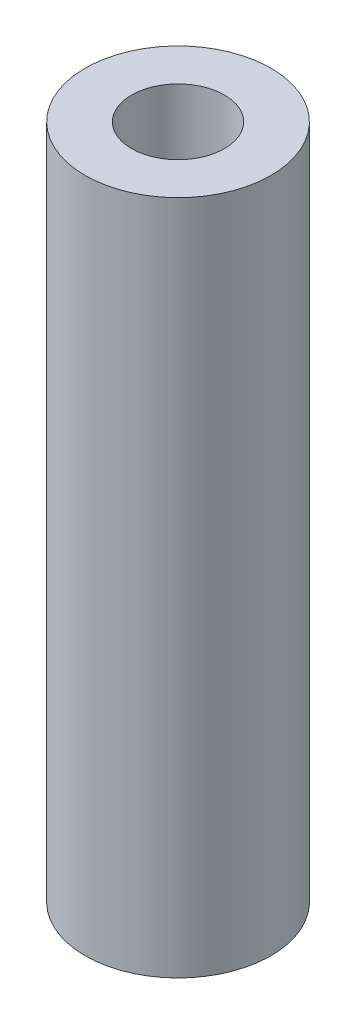
ISO-10303-21;
HEADER;
FILE_DESCRIPTION(('STEP AP214'),'2;1');
FILE_NAME('part.step','',(''),(''),'','','');
FILE_SCHEMA(('AUTOMOTIVE_DESIGN { 1 0 10303 214 1 1 1 1 }'));
ENDSEC;
DATA;
#1=APPLICATION_CONTEXT('core data for automotive mechanical design processes');
#2=APPLICATION_PROTOCOL_DEFINITION('international standard','automotive_design',2000,#1);
#3=PRODUCT_CONTEXT('',#1,'mechanical');
#4=PRODUCT('Part','Part','',(#3));
#5=PRODUCT_RELATED_PRODUCT_CATEGORY('part','',(#4));
#6=PRODUCT_DEFINITION_FORMATION('','',#4);
#7=PRODUCT_DEFINITION_CONTEXT('part definition',#1,'design');
#8=PRODUCT_DEFINITION('design','',#6,#7);
#9=PRODUCT_DEFINITION_SHAPE('','',#8);
#10=(LENGTH_UNIT() NAMED_UNIT(*) SI_UNIT(.MILLI.,.METRE.));
#11=(NAMED_UNIT(*) PLANE_ANGLE_UNIT() SI_UNIT($,.RADIAN.));
#12=(NAMED_UNIT(*) SI_UNIT($,.STERADIAN.) SOLID_ANGLE_UNIT());
#13=UNCERTAINTY_MEASURE_WITH_UNIT(LENGTH_MEASURE(1.E-05),#10,'distance_accuracy_value','');
#14=(GEOMETRIC_REPRESENTATION_CONTEXT(3) GLOBAL_UNCERTAINTY_ASSIGNED_CONTEXT((#13)) GLOBAL_UNIT_ASSIGNED_CONTEXT((#10,
#11,#12)) REPRESENTATION_CONTEXT('',''));
#15=CARTESIAN_POINT('',(0.,0.,0.));
#16=DIRECTION('',(0.,0.,1.));
#17=DIRECTION('',(1.,0.,0.));
#18=AXIS2_PLACEMENT_3D('',#15,#16,#17);
#19=CARTESIAN_POINT('',(0.,40.,0.));
#20=DIRECTION('',(0.,1.,0.));
#21=DIRECTION('',(0.,0.,1.));
#22=AXIS2_PLACEMENT_3D('',#19,#20,#21);
#23=PLANE('',#22);
#24=CARTESIAN_POINT('',(0.,40.,0.));
#25=DIRECTION('',(0.,1.,0.));
#26=DIRECTION('',(0.,0.,1.));
#27=AXIS2_PLACEMENT_3D('',#24,#25,#26);
#28=CIRCLE('',#27,11.);
#29=CARTESIAN_POINT('',(0.,40.,11.));
#30=VERTEX_POINT('',#29);
#31=EDGE_CURVE('E10',#30,#30,#28,.T.);
#32=ORIENTED_EDGE('',*,*,#31,.T.);
#33=EDGE_LOOP('',(#32));
#34=FACE_BOUND('',#33,.T.);
#35=CARTESIAN_POINT('',(0.,40.,0.));
#36=DIRECTION('',(0.,1.,0.));
#37=DIRECTION('',(0.,0.,1.));
#38=AXIS2_PLACEMENT_3D('',#35,#36,#37);
#39=CIRCLE('',#38,5.5);
#40=CARTESIAN_POINT('',(0.,40.,5.5));
#41=VERTEX_POINT('',#40);
#42=EDGE_CURVE('E50',#41,#41,#39,.T.);
#43=ORIENTED_EDGE('',*,*,#42,.F.);
#44=EDGE_LOOP('',(#43));
#45=FACE_BOUND('',#44,.T.);
#46=ADVANCED_FACE('F37',(#34,#45),#23,.T.);
#47=CARTESIAN_POINT('',(0.,-40.,0.));
#48=DIRECTION('',(0.,1.,0.));
#49=DIRECTION('',(0.,0.,1.));
#50=AXIS2_PLACEMENT_3D('',#47,#48,#49);
#51=PLANE('',#50);
#52=CARTESIAN_POINT('',(0.,-40.,0.));
#53=DIRECTION('',(0.,1.,0.));
#54=DIRECTION('',(0.,0.,1.));
#55=AXIS2_PLACEMENT_3D('',#52,#53,#54);
#56=CIRCLE('',#55,11.);
#57=CARTESIAN_POINT('',(0.,-40.,11.));
#58=VERTEX_POINT('',#57);
#59=EDGE_CURVE('E41',#58,#58,#56,.T.);
#60=ORIENTED_EDGE('',*,*,#59,.F.);
#61=EDGE_LOOP('',(#60));
#62=FACE_BOUND('',#61,.T.);
#63=CARTESIAN_POINT('',(0.,-40.,0.));
#64=DIRECTION('',(0.,1.,0.));
#65=DIRECTION('',(0.,0.,1.));
#66=AXIS2_PLACEMENT_3D('',#63,#64,#65);
#67=CIRCLE('',#66,5.5);
#68=CARTESIAN_POINT('',(0.,-40.,5.5));
#69=VERTEX_POINT('',#68);
#70=EDGE_CURVE('E52',#69,#69,#67,.T.);
#71=ORIENTED_EDGE('',*,*,#70,.T.);
#72=EDGE_LOOP('',(#71));
#73=FACE_BOUND('',#72,.T.);
#74=ADVANCED_FACE('F64',(#62,#73),#51,.F.);
#75=CARTESIAN_POINT('',(0.,40.,0.));
#76=DIRECTION('',(0.,-1.,0.));
#77=DIRECTION('',(0.,0.,-1.));
#78=AXIS2_PLACEMENT_3D('',#75,#76,#77);
#79=CYLINDRICAL_SURFACE('',#78,11.);
#80=ORIENTED_EDGE('',*,*,#31,.F.);
#81=EDGE_LOOP('',(#80));
#82=FACE_BOUND('',#81,.T.);
#83=ORIENTED_EDGE('',*,*,#59,.T.);
#84=EDGE_LOOP('',(#83));
#85=FACE_BOUND('',#84,.T.);
#86=ADVANCED_FACE('F39',(#82,#85),#79,.T.);
#87=CARTESIAN_POINT('',(0.,40.,0.));
#88=DIRECTION('',(0.,-1.,0.));
#89=DIRECTION('',(0.,0.,-1.));
#90=AXIS2_PLACEMENT_3D('',#87,#88,#89);
#91=CYLINDRICAL_SURFACE('',#90,5.5);
#92=ORIENTED_EDGE('',*,*,#42,.T.);
#93=EDGE_LOOP('',(#92));
#94=FACE_BOUND('',#93,.T.);
#95=ORIENTED_EDGE('',*,*,#70,.F.);
#96=EDGE_LOOP('',(#95));
#97=FACE_BOUND('',#96,.T.);
#98=ADVANCED_FACE('F60',(#94,#97),#91,.F.);
#99=CLOSED_SHELL('',(#46,#74,#86,#98));
#100=MANIFOLD_SOLID_BREP('B2',#99);
#101=ADVANCED_BREP_SHAPE_REPRESENTATION('',(#18,#100),#14);
#102=SHAPE_DEFINITION_REPRESENTATION(#9,#101);
ENDSEC;
END-ISO-10303-21;
